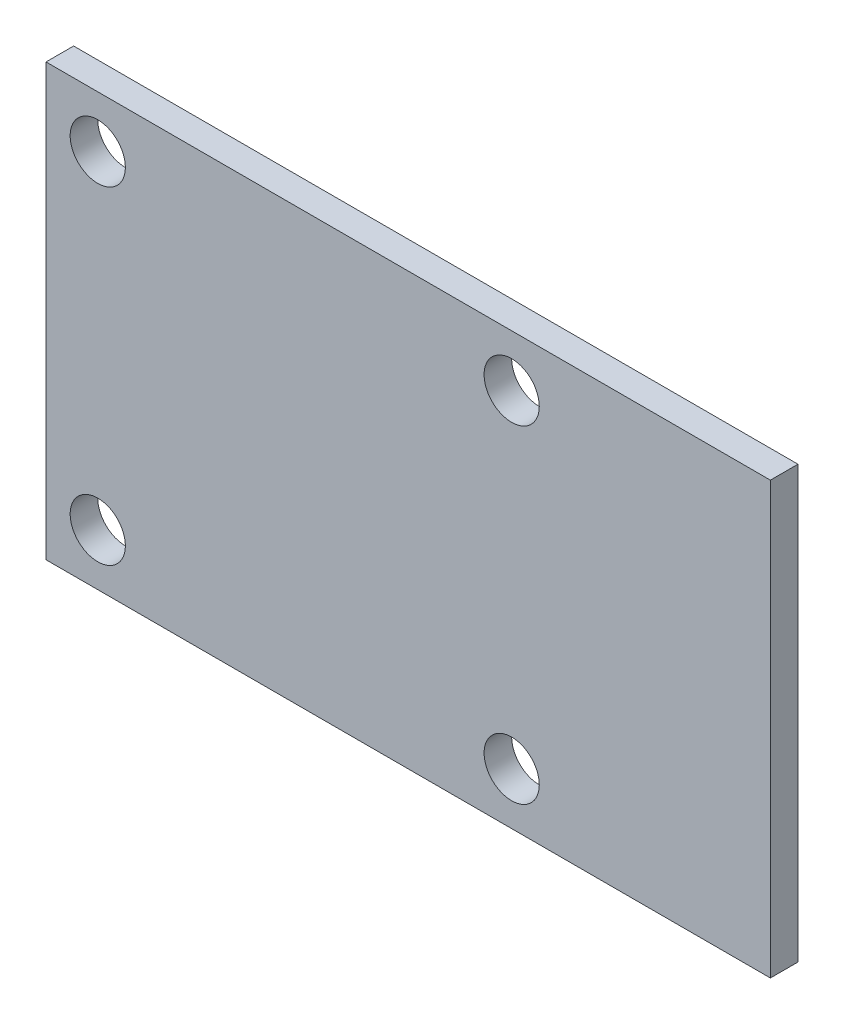
ISO-10303-21;
HEADER;
FILE_DESCRIPTION(('STEP AP214'),'2;1');
FILE_NAME('part.step','',(''),(''),'','','');
FILE_SCHEMA(('AUTOMOTIVE_DESIGN { 1 0 10303 214 1 1 1 1 }'));
ENDSEC;
DATA;
#1=APPLICATION_CONTEXT('core data for automotive mechanical design processes');
#2=APPLICATION_PROTOCOL_DEFINITION('international standard','automotive_design',2000,#1);
#3=PRODUCT_CONTEXT('',#1,'mechanical');
#4=PRODUCT('Part','Part','',(#3));
#5=PRODUCT_RELATED_PRODUCT_CATEGORY('part','',(#4));
#6=PRODUCT_DEFINITION_FORMATION('','',#4);
#7=PRODUCT_DEFINITION_CONTEXT('part definition',#1,'design');
#8=PRODUCT_DEFINITION('design','',#6,#7);
#9=PRODUCT_DEFINITION_SHAPE('','',#8);
#10=(LENGTH_UNIT() NAMED_UNIT(*) SI_UNIT(.MILLI.,.METRE.));
#11=(NAMED_UNIT(*) PLANE_ANGLE_UNIT() SI_UNIT($,.RADIAN.));
#12=(NAMED_UNIT(*) SI_UNIT($,.STERADIAN.) SOLID_ANGLE_UNIT());
#13=UNCERTAINTY_MEASURE_WITH_UNIT(LENGTH_MEASURE(1.E-05),#10,'distance_accuracy_value','');
#14=(GEOMETRIC_REPRESENTATION_CONTEXT(3) GLOBAL_UNCERTAINTY_ASSIGNED_CONTEXT((#13)) GLOBAL_UNIT_ASSIGNED_CONTEXT((#10,
#11,#12)) REPRESENTATION_CONTEXT('',''));
#15=CARTESIAN_POINT('',(0.,0.,0.));
#16=DIRECTION('',(0.,0.,1.));
#17=DIRECTION('',(1.,0.,0.));
#18=AXIS2_PLACEMENT_3D('',#15,#16,#17);
#19=CARTESIAN_POINT('',(-21.,-12.5,1.6));
#20=DIRECTION('',(1.,0.,0.));
#21=DIRECTION('',(0.,0.,-1.));
#22=AXIS2_PLACEMENT_3D('',#19,#20,#21);
#23=PLANE('',#22);
#24=DIRECTION('',(0.,-1.,0.));
#25=VECTOR('',#24,1.);
#26=CARTESIAN_POINT('',(-21.,-12.5,0.));
#27=LINE('',#26,#25);
#28=CARTESIAN_POINT('',(-21.,12.5,0.));
#29=VERTEX_POINT('',#28);
#30=CARTESIAN_POINT('',(-21.,-12.5,0.));
#31=VERTEX_POINT('',#30);
#32=EDGE_CURVE('E99',#29,#31,#27,.T.);
#33=ORIENTED_EDGE('',*,*,#32,.T.);
#34=DIRECTION('',(0.,0.,-1.));
#35=VECTOR('',#34,1.);
#36=CARTESIAN_POINT('',(-21.,-12.5,1.6));
#37=LINE('',#36,#35);
#38=CARTESIAN_POINT('',(-21.,-12.5,1.6));
#39=VERTEX_POINT('',#38);
#40=EDGE_CURVE('E11',#39,#31,#37,.T.);
#41=ORIENTED_EDGE('',*,*,#40,.F.);
#42=DIRECTION('',(0.,-1.,0.));
#43=VECTOR('',#42,1.);
#44=CARTESIAN_POINT('',(-21.,-12.5,1.6));
#45=LINE('',#44,#43);
#46=CARTESIAN_POINT('',(-21.,12.5,1.6));
#47=VERTEX_POINT('',#46);
#48=EDGE_CURVE('E87',#47,#39,#45,.T.);
#49=ORIENTED_EDGE('',*,*,#48,.F.);
#50=DIRECTION('',(0.,0.,-1.));
#51=VECTOR('',#50,1.);
#52=CARTESIAN_POINT('',(-21.,12.5,1.6));
#53=LINE('',#52,#51);
#54=EDGE_CURVE('E95',#47,#29,#53,.T.);
#55=ORIENTED_EDGE('',*,*,#54,.T.);
#56=EDGE_LOOP('',(#33,#41,#49,#55));
#57=FACE_BOUND('',#56,.T.);
#58=ADVANCED_FACE('F36',(#57),#23,.F.);
#59=CARTESIAN_POINT('',(21.,-12.5,1.6));
#60=DIRECTION('',(0.,1.,0.));
#61=DIRECTION('',(-1.,0.,0.));
#62=AXIS2_PLACEMENT_3D('',#59,#60,#61);
#63=PLANE('',#62);
#64=DIRECTION('',(1.,0.,0.));
#65=VECTOR('',#64,1.);
#66=CARTESIAN_POINT('',(21.,-12.5,0.));
#67=LINE('',#66,#65);
#68=CARTESIAN_POINT('',(21.,-12.5,0.));
#69=VERTEX_POINT('',#68);
#70=EDGE_CURVE('E91',#31,#69,#67,.T.);
#71=ORIENTED_EDGE('',*,*,#70,.T.);
#72=DIRECTION('',(0.,0.,-1.));
#73=VECTOR('',#72,1.);
#74=CARTESIAN_POINT('',(21.,-12.5,1.6));
#75=LINE('',#74,#73);
#76=CARTESIAN_POINT('',(21.,-12.5,1.6));
#77=VERTEX_POINT('',#76);
#78=EDGE_CURVE('E44',#77,#69,#75,.T.);
#79=ORIENTED_EDGE('',*,*,#78,.F.);
#80=DIRECTION('',(1.,0.,0.));
#81=VECTOR('',#80,1.);
#82=CARTESIAN_POINT('',(21.,-12.5,1.6));
#83=LINE('',#82,#81);
#84=EDGE_CURVE('E82',#39,#77,#83,.T.);
#85=ORIENTED_EDGE('',*,*,#84,.F.);
#86=ORIENTED_EDGE('',*,*,#40,.T.);
#87=EDGE_LOOP('',(#71,#79,#85,#86));
#88=FACE_BOUND('',#87,.T.);
#89=ADVANCED_FACE('F90',(#88),#63,.F.);
#90=CARTESIAN_POINT('',(21.,-12.5,1.6));
#91=DIRECTION('',(-1.,0.,0.));
#92=DIRECTION('',(0.,0.,1.));
#93=AXIS2_PLACEMENT_3D('',#90,#91,#92);
#94=PLANE('',#93);
#95=DIRECTION('',(0.,1.,0.));
#96=VECTOR('',#95,1.);
#97=CARTESIAN_POINT('',(21.,-12.5,0.));
#98=LINE('',#97,#96);
#99=CARTESIAN_POINT('',(21.,12.5,0.));
#100=VERTEX_POINT('',#99);
#101=EDGE_CURVE('E69',#69,#100,#98,.T.);
#102=ORIENTED_EDGE('',*,*,#101,.T.);
#103=DIRECTION('',(0.,0.,-1.));
#104=VECTOR('',#103,1.);
#105=CARTESIAN_POINT('',(21.,12.5,1.6));
#106=LINE('',#105,#104);
#107=CARTESIAN_POINT('',(21.,12.5,1.6));
#108=VERTEX_POINT('',#107);
#109=EDGE_CURVE('E92',#108,#100,#106,.T.);
#110=ORIENTED_EDGE('',*,*,#109,.F.);
#111=DIRECTION('',(0.,1.,0.));
#112=VECTOR('',#111,1.);
#113=CARTESIAN_POINT('',(21.,-12.5,1.6));
#114=LINE('',#113,#112);
#115=EDGE_CURVE('E85',#77,#108,#114,.T.);
#116=ORIENTED_EDGE('',*,*,#115,.F.);
#117=ORIENTED_EDGE('',*,*,#78,.T.);
#118=EDGE_LOOP('',(#102,#110,#116,#117));
#119=FACE_BOUND('',#118,.T.);
#120=ADVANCED_FACE('F93',(#119),#94,.F.);
#121=CARTESIAN_POINT('',(21.,12.5,1.6));
#122=DIRECTION('',(0.,-1.,0.));
#123=DIRECTION('',(1.,0.,0.));
#124=AXIS2_PLACEMENT_3D('',#121,#122,#123);
#125=PLANE('',#124);
#126=DIRECTION('',(-1.,0.,0.));
#127=VECTOR('',#126,1.);
#128=CARTESIAN_POINT('',(21.,12.5,0.));
#129=LINE('',#128,#127);
#130=EDGE_CURVE('E75',#100,#29,#129,.T.);
#131=ORIENTED_EDGE('',*,*,#130,.T.);
#132=ORIENTED_EDGE('',*,*,#54,.F.);
#133=DIRECTION('',(-1.,0.,0.));
#134=VECTOR('',#133,1.);
#135=CARTESIAN_POINT('',(21.,12.5,1.6));
#136=LINE('',#135,#134);
#137=EDGE_CURVE('E52',#108,#47,#136,.T.);
#138=ORIENTED_EDGE('',*,*,#137,.F.);
#139=ORIENTED_EDGE('',*,*,#109,.T.);
#140=EDGE_LOOP('',(#131,#132,#138,#139));
#141=FACE_BOUND('',#140,.T.);
#142=ADVANCED_FACE('F107',(#141),#125,.F.);
#143=CARTESIAN_POINT('',(0.,0.,1.6));
#144=DIRECTION('',(0.,0.,1.));
#145=DIRECTION('',(1.,0.,0.));
#146=AXIS2_PLACEMENT_3D('',#143,#144,#145);
#147=PLANE('',#146);
#148=CARTESIAN_POINT('',(-18.,-9.5,1.6));
#149=DIRECTION('',(0.,0.,1.));
#150=DIRECTION('',(1.,0.,0.));
#151=AXIS2_PLACEMENT_3D('',#148,#149,#150);
#152=CIRCLE('',#151,1.6);
#153=CARTESIAN_POINT('',(-16.4,-9.5,1.6));
#154=VERTEX_POINT('',#153);
#155=EDGE_CURVE('E134',#154,#154,#152,.T.);
#156=ORIENTED_EDGE('',*,*,#155,.F.);
#157=EDGE_LOOP('',(#156));
#158=FACE_BOUND('',#157,.T.);
#159=CARTESIAN_POINT('',(6.,9.5,1.6));
#160=DIRECTION('',(0.,0.,1.));
#161=DIRECTION('',(1.,0.,0.));
#162=AXIS2_PLACEMENT_3D('',#159,#160,#161);
#163=CIRCLE('',#162,1.6);
#164=CARTESIAN_POINT('',(7.6,9.5,1.6));
#165=VERTEX_POINT('',#164);
#166=EDGE_CURVE('E126',#165,#165,#163,.T.);
#167=ORIENTED_EDGE('',*,*,#166,.F.);
#168=EDGE_LOOP('',(#167));
#169=FACE_BOUND('',#168,.T.);
#170=CARTESIAN_POINT('',(6.00000000000001,-9.5,1.6));
#171=DIRECTION('',(0.,0.,1.));
#172=DIRECTION('',(1.,0.,0.));
#173=AXIS2_PLACEMENT_3D('',#170,#171,#172);
#174=CIRCLE('',#173,1.6);
#175=CARTESIAN_POINT('',(7.60000000000001,-9.5,1.6));
#176=VERTEX_POINT('',#175);
#177=EDGE_CURVE('E120',#176,#176,#174,.T.);
#178=ORIENTED_EDGE('',*,*,#177,.F.);
#179=EDGE_LOOP('',(#178));
#180=FACE_BOUND('',#179,.T.);
#181=CARTESIAN_POINT('',(-18.,9.5,1.6));
#182=DIRECTION('',(0.,0.,1.));
#183=DIRECTION('',(1.,0.,0.));
#184=AXIS2_PLACEMENT_3D('',#181,#182,#183);
#185=CIRCLE('',#184,1.6);
#186=CARTESIAN_POINT('',(-16.4,9.5,1.6));
#187=VERTEX_POINT('',#186);
#188=EDGE_CURVE('E113',#187,#187,#185,.T.);
#189=ORIENTED_EDGE('',*,*,#188,.F.);
#190=EDGE_LOOP('',(#189));
#191=FACE_BOUND('',#190,.T.);
#192=ORIENTED_EDGE('',*,*,#48,.T.);
#193=ORIENTED_EDGE('',*,*,#84,.T.);
#194=ORIENTED_EDGE('',*,*,#115,.T.);
#195=ORIENTED_EDGE('',*,*,#137,.T.);
#196=EDGE_LOOP('',(#192,#193,#194,#195));
#197=FACE_BOUND('',#196,.T.);
#198=ADVANCED_FACE('F83',(#158,#169,#180,#191,#197),#147,.T.);
#199=CARTESIAN_POINT('',(0.,0.,0.));
#200=DIRECTION('',(0.,0.,1.));
#201=DIRECTION('',(1.,0.,0.));
#202=AXIS2_PLACEMENT_3D('',#199,#200,#201);
#203=PLANE('',#202);
#204=CARTESIAN_POINT('',(-18.,-9.5,0.));
#205=DIRECTION('',(0.,0.,1.));
#206=DIRECTION('',(1.,0.,0.));
#207=AXIS2_PLACEMENT_3D('',#204,#205,#206);
#208=CIRCLE('',#207,1.6);
#209=CARTESIAN_POINT('',(-16.4,-9.5,0.));
#210=VERTEX_POINT('',#209);
#211=EDGE_CURVE('E117',#210,#210,#208,.T.);
#212=ORIENTED_EDGE('',*,*,#211,.T.);
#213=EDGE_LOOP('',(#212));
#214=FACE_BOUND('',#213,.T.);
#215=CARTESIAN_POINT('',(6.,9.5,0.));
#216=DIRECTION('',(0.,0.,1.));
#217=DIRECTION('',(1.,0.,0.));
#218=AXIS2_PLACEMENT_3D('',#215,#216,#217);
#219=CIRCLE('',#218,1.6);
#220=CARTESIAN_POINT('',(7.6,9.5,0.));
#221=VERTEX_POINT('',#220);
#222=EDGE_CURVE('E130',#221,#221,#219,.T.);
#223=ORIENTED_EDGE('',*,*,#222,.T.);
#224=EDGE_LOOP('',(#223));
#225=FACE_BOUND('',#224,.T.);
#226=CARTESIAN_POINT('',(6.00000000000001,-9.5,0.));
#227=DIRECTION('',(0.,0.,1.));
#228=DIRECTION('',(1.,0.,0.));
#229=AXIS2_PLACEMENT_3D('',#226,#227,#228);
#230=CIRCLE('',#229,1.6);
#231=CARTESIAN_POINT('',(7.60000000000001,-9.5,0.));
#232=VERTEX_POINT('',#231);
#233=EDGE_CURVE('E123',#232,#232,#230,.T.);
#234=ORIENTED_EDGE('',*,*,#233,.T.);
#235=EDGE_LOOP('',(#234));
#236=FACE_BOUND('',#235,.T.);
#237=CARTESIAN_POINT('',(-18.,9.5,0.));
#238=DIRECTION('',(0.,0.,1.));
#239=DIRECTION('',(1.,0.,0.));
#240=AXIS2_PLACEMENT_3D('',#237,#238,#239);
#241=CIRCLE('',#240,1.6);
#242=CARTESIAN_POINT('',(-16.4,9.5,0.));
#243=VERTEX_POINT('',#242);
#244=EDGE_CURVE('E102',#243,#243,#241,.T.);
#245=ORIENTED_EDGE('',*,*,#244,.T.);
#246=EDGE_LOOP('',(#245));
#247=FACE_BOUND('',#246,.T.);
#248=ORIENTED_EDGE('',*,*,#32,.F.);
#249=ORIENTED_EDGE('',*,*,#130,.F.);
#250=ORIENTED_EDGE('',*,*,#101,.F.);
#251=ORIENTED_EDGE('',*,*,#70,.F.);
#252=EDGE_LOOP('',(#248,#249,#250,#251));
#253=FACE_BOUND('',#252,.T.);
#254=ADVANCED_FACE('F110',(#214,#225,#236,#247,#253),#203,.F.);
#255=CARTESIAN_POINT('',(-18.,9.5,0.));
#256=DIRECTION('',(0.,0.,1.));
#257=DIRECTION('',(1.,0.,0.));
#258=AXIS2_PLACEMENT_3D('',#255,#256,#257);
#259=CYLINDRICAL_SURFACE('',#258,1.6);
#260=ORIENTED_EDGE('',*,*,#244,.F.);
#261=EDGE_LOOP('',(#260));
#262=FACE_BOUND('',#261,.T.);
#263=ORIENTED_EDGE('',*,*,#188,.T.);
#264=EDGE_LOOP('',(#263));
#265=FACE_BOUND('',#264,.T.);
#266=ADVANCED_FACE('F159',(#262,#265),#259,.F.);
#267=CARTESIAN_POINT('',(6.00000000000001,-9.5,0.));
#268=DIRECTION('',(0.,0.,1.));
#269=DIRECTION('',(1.,0.,0.));
#270=AXIS2_PLACEMENT_3D('',#267,#268,#269);
#271=CYLINDRICAL_SURFACE('',#270,1.6);
#272=ORIENTED_EDGE('',*,*,#233,.F.);
#273=EDGE_LOOP('',(#272));
#274=FACE_BOUND('',#273,.T.);
#275=ORIENTED_EDGE('',*,*,#177,.T.);
#276=EDGE_LOOP('',(#275));
#277=FACE_BOUND('',#276,.T.);
#278=ADVANCED_FACE('F161',(#274,#277),#271,.F.);
#279=CARTESIAN_POINT('',(6.,9.5,0.));
#280=DIRECTION('',(0.,0.,1.));
#281=DIRECTION('',(1.,0.,0.));
#282=AXIS2_PLACEMENT_3D('',#279,#280,#281);
#283=CYLINDRICAL_SURFACE('',#282,1.6);
#284=ORIENTED_EDGE('',*,*,#222,.F.);
#285=EDGE_LOOP('',(#284));
#286=FACE_BOUND('',#285,.T.);
#287=ORIENTED_EDGE('',*,*,#166,.T.);
#288=EDGE_LOOP('',(#287));
#289=FACE_BOUND('',#288,.T.);
#290=ADVANCED_FACE('F146',(#286,#289),#283,.F.);
#291=CARTESIAN_POINT('',(-18.,-9.5,0.));
#292=DIRECTION('',(0.,0.,1.));
#293=DIRECTION('',(1.,0.,0.));
#294=AXIS2_PLACEMENT_3D('',#291,#292,#293);
#295=CYLINDRICAL_SURFACE('',#294,1.6);
#296=ORIENTED_EDGE('',*,*,#211,.F.);
#297=EDGE_LOOP('',(#296));
#298=FACE_BOUND('',#297,.T.);
#299=ORIENTED_EDGE('',*,*,#155,.T.);
#300=EDGE_LOOP('',(#299));
#301=FACE_BOUND('',#300,.T.);
#302=ADVANCED_FACE('F143',(#298,#301),#295,.F.);
#303=CLOSED_SHELL('',(#58,#89,#120,#142,#198,#254,#266,#278,#290,#302));
#304=MANIFOLD_SOLID_BREP('B2',#303);
#305=ADVANCED_BREP_SHAPE_REPRESENTATION('',(#18,#304),#14);
#306=SHAPE_DEFINITION_REPRESENTATION(#9,#305);
ENDSEC;
END-ISO-10303-21;
